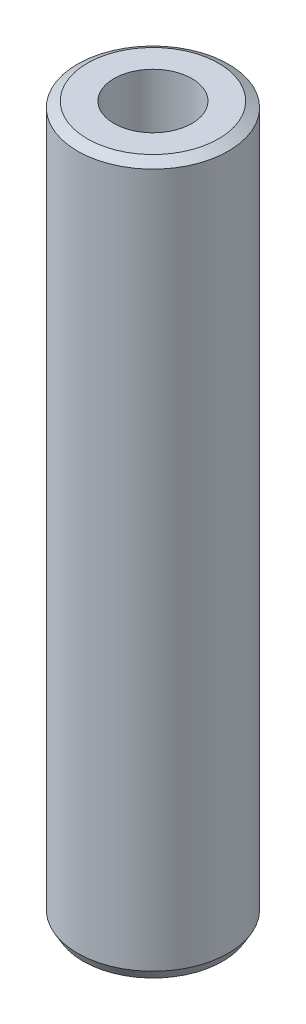
ISO-10303-21;
HEADER;
FILE_DESCRIPTION(('STEP AP214'),'2;1');
FILE_NAME('part.step','',(''),(''),'','','');
FILE_SCHEMA(('AUTOMOTIVE_DESIGN { 1 0 10303 214 1 1 1 1 }'));
ENDSEC;
DATA;
#1=APPLICATION_CONTEXT('core data for automotive mechanical design processes');
#2=APPLICATION_PROTOCOL_DEFINITION('international standard','automotive_design',2000,#1);
#3=PRODUCT_CONTEXT('',#1,'mechanical');
#4=PRODUCT('Part','Part','',(#3));
#5=PRODUCT_RELATED_PRODUCT_CATEGORY('part','',(#4));
#6=PRODUCT_DEFINITION_FORMATION('','',#4);
#7=PRODUCT_DEFINITION_CONTEXT('part definition',#1,'design');
#8=PRODUCT_DEFINITION('design','',#6,#7);
#9=PRODUCT_DEFINITION_SHAPE('','',#8);
#10=(LENGTH_UNIT() NAMED_UNIT(*) SI_UNIT(.MILLI.,.METRE.));
#11=(NAMED_UNIT(*) PLANE_ANGLE_UNIT() SI_UNIT($,.RADIAN.));
#12=(NAMED_UNIT(*) SI_UNIT($,.STERADIAN.) SOLID_ANGLE_UNIT());
#13=UNCERTAINTY_MEASURE_WITH_UNIT(LENGTH_MEASURE(1.E-05),#10,'distance_accuracy_value','');
#14=(GEOMETRIC_REPRESENTATION_CONTEXT(3) GLOBAL_UNCERTAINTY_ASSIGNED_CONTEXT((#13)) GLOBAL_UNIT_ASSIGNED_CONTEXT((#10,
#11,#12)) REPRESENTATION_CONTEXT('',''));
#15=CARTESIAN_POINT('',(0.,0.,0.));
#16=DIRECTION('',(0.,0.,1.));
#17=DIRECTION('',(1.,0.,0.));
#18=AXIS2_PLACEMENT_3D('',#15,#16,#17);
#19=CARTESIAN_POINT('',(0.,423.67524934273,0.));
#20=DIRECTION('',(0.,-1.,0.));
#21=DIRECTION('',(0.,0.,-1.));
#22=AXIS2_PLACEMENT_3D('',#19,#20,#21);
#23=CYLINDRICAL_SURFACE('',#22,45.);
#24=CARTESIAN_POINT('',(0.,420.281907298068,0.));
#25=DIRECTION('',(0.,1.,0.));
#26=DIRECTION('',(0.,0.,1.));
#27=AXIS2_PLACEMENT_3D('',#24,#25,#26);
#28=CIRCLE('',#27,45.);
#29=CARTESIAN_POINT('',(0.,420.281907298068,45.));
#30=VERTEX_POINT('',#29);
#31=EDGE_CURVE('E50',#30,#30,#28,.F.);
#32=ORIENTED_EDGE('',*,*,#31,.T.);
#33=EDGE_LOOP('',(#32));
#34=FACE_BOUND('',#33,.T.);
#35=CARTESIAN_POINT('',(0.,5.87744082881353,0.));
#36=DIRECTION('',(0.,1.,0.));
#37=DIRECTION('',(0.,0.,1.));
#38=AXIS2_PLACEMENT_3D('',#35,#36,#37);
#39=CIRCLE('',#38,45.);
#40=CARTESIAN_POINT('',(0.,5.87744082881353,45.));
#41=VERTEX_POINT('',#40);
#42=EDGE_CURVE('E51',#41,#41,#39,.T.);
#43=ORIENTED_EDGE('',*,*,#42,.T.);
#44=EDGE_LOOP('',(#43));
#45=FACE_BOUND('',#44,.T.);
#46=ADVANCED_FACE('F39',(#34,#45),#23,.T.);
#47=CARTESIAN_POINT('',(0.,423.67524934273,0.));
#48=DIRECTION('',(0.,1.,0.));
#49=DIRECTION('',(0.,0.,1.));
#50=AXIS2_PLACEMENT_3D('',#47,#48,#49);
#51=PLANE('',#50);
#52=CARTESIAN_POINT('',(0.,423.67524934273,0.));
#53=DIRECTION('',(0.,1.,0.));
#54=DIRECTION('',(0.,0.,1.));
#55=AXIS2_PLACEMENT_3D('',#52,#53,#54);
#56=CIRCLE('',#55,39.1225591711867);
#57=CARTESIAN_POINT('',(0.,423.67524934273,39.1225591711867));
#58=VERTEX_POINT('',#57);
#59=EDGE_CURVE('E54',#58,#58,#56,.T.);
#60=ORIENTED_EDGE('',*,*,#59,.T.);
#61=EDGE_LOOP('',(#60));
#62=FACE_BOUND('',#61,.T.);
#63=CARTESIAN_POINT('',(0.,423.67524934273,0.));
#64=DIRECTION('',(0.,1.,0.));
#65=DIRECTION('',(0.,0.,1.));
#66=AXIS2_PLACEMENT_3D('',#63,#64,#65);
#67=CIRCLE('',#66,23.2344713857836);
#68=CARTESIAN_POINT('',(0.,423.67524934273,23.2344713857836));
#69=VERTEX_POINT('',#68);
#70=EDGE_CURVE('E58',#69,#69,#67,.T.);
#71=ORIENTED_EDGE('',*,*,#70,.F.);
#72=EDGE_LOOP('',(#71));
#73=FACE_BOUND('',#72,.T.);
#74=ADVANCED_FACE('F69',(#62,#73),#51,.T.);
#75=CARTESIAN_POINT('',(0.,0.,0.));
#76=DIRECTION('',(0.,1.,0.));
#77=DIRECTION('',(0.,0.,1.));
#78=AXIS2_PLACEMENT_3D('',#75,#76,#77);
#79=PLANE('',#78);
#80=CARTESIAN_POINT('',(0.,0.,0.));
#81=DIRECTION('',(0.,1.,0.));
#82=DIRECTION('',(0.,0.,1.));
#83=AXIS2_PLACEMENT_3D('',#80,#81,#82);
#84=CIRCLE('',#83,41.6066579553384);
#85=CARTESIAN_POINT('',(0.,0.,41.6066579553384));
#86=VERTEX_POINT('',#85);
#87=EDGE_CURVE('E10',#86,#86,#84,.F.);
#88=ORIENTED_EDGE('',*,*,#87,.T.);
#89=EDGE_LOOP('',(#88));
#90=FACE_BOUND('',#89,.T.);
#91=CARTESIAN_POINT('',(0.,0.,0.));
#92=DIRECTION('',(0.,1.,0.));
#93=DIRECTION('',(0.,0.,1.));
#94=AXIS2_PLACEMENT_3D('',#91,#92,#93);
#95=CIRCLE('',#94,23.2344713857836);
#96=CARTESIAN_POINT('',(0.,0.,23.2344713857836));
#97=VERTEX_POINT('',#96);
#98=EDGE_CURVE('E63',#97,#97,#95,.T.);
#99=ORIENTED_EDGE('',*,*,#98,.T.);
#100=EDGE_LOOP('',(#99));
#101=FACE_BOUND('',#100,.T.);
#102=ADVANCED_FACE('F75',(#90,#101),#79,.F.);
#103=CARTESIAN_POINT('',(0.,423.67524934273,0.));
#104=DIRECTION('',(0.,-1.,0.));
#105=DIRECTION('',(0.,0.,-1.));
#106=AXIS2_PLACEMENT_3D('',#103,#104,#105);
#107=CYLINDRICAL_SURFACE('',#106,23.2344713857836);
#108=ORIENTED_EDGE('',*,*,#70,.T.);
#109=EDGE_LOOP('',(#108));
#110=FACE_BOUND('',#109,.T.);
#111=ORIENTED_EDGE('',*,*,#98,.F.);
#112=EDGE_LOOP('',(#111));
#113=FACE_BOUND('',#112,.T.);
#114=ADVANCED_FACE('F70',(#110,#113),#107,.F.);
#115=CARTESIAN_POINT('',(0.,423.67524934273,0.));
#116=DIRECTION('',(0.,-1.,0.));
#117=DIRECTION('',(0.,0.,-1.));
#118=AXIS2_PLACEMENT_3D('',#115,#116,#117);
#119=CONICAL_SURFACE('',#118,39.1225591711867,1.04719755119659);
#120=ORIENTED_EDGE('',*,*,#31,.F.);
#121=EDGE_LOOP('',(#120));
#122=FACE_BOUND('',#121,.T.);
#123=ORIENTED_EDGE('',*,*,#59,.F.);
#124=EDGE_LOOP('',(#123));
#125=FACE_BOUND('',#124,.T.);
#126=ADVANCED_FACE('F81',(#122,#125),#119,.T.);
#127=CARTESIAN_POINT('',(0.,5.87744082881353,0.));
#128=DIRECTION('',(0.,1.,0.));
#129=DIRECTION('',(0.,0.,1.));
#130=AXIS2_PLACEMENT_3D('',#127,#128,#129);
#131=CONICAL_SURFACE('',#130,45.,0.523598775598307);
#132=ORIENTED_EDGE('',*,*,#87,.F.);
#133=EDGE_LOOP('',(#132));
#134=FACE_BOUND('',#133,.T.);
#135=ORIENTED_EDGE('',*,*,#42,.F.);
#136=EDGE_LOOP('',(#135));
#137=FACE_BOUND('',#136,.T.);
#138=ADVANCED_FACE('F45',(#134,#137),#131,.T.);
#139=CLOSED_SHELL('',(#46,#74,#102,#114,#126,#138));
#140=MANIFOLD_SOLID_BREP('B2',#139);
#141=ADVANCED_BREP_SHAPE_REPRESENTATION('',(#18,#140),#14);
#142=SHAPE_DEFINITION_REPRESENTATION(#9,#141);
ENDSEC;
END-ISO-10303-21;
